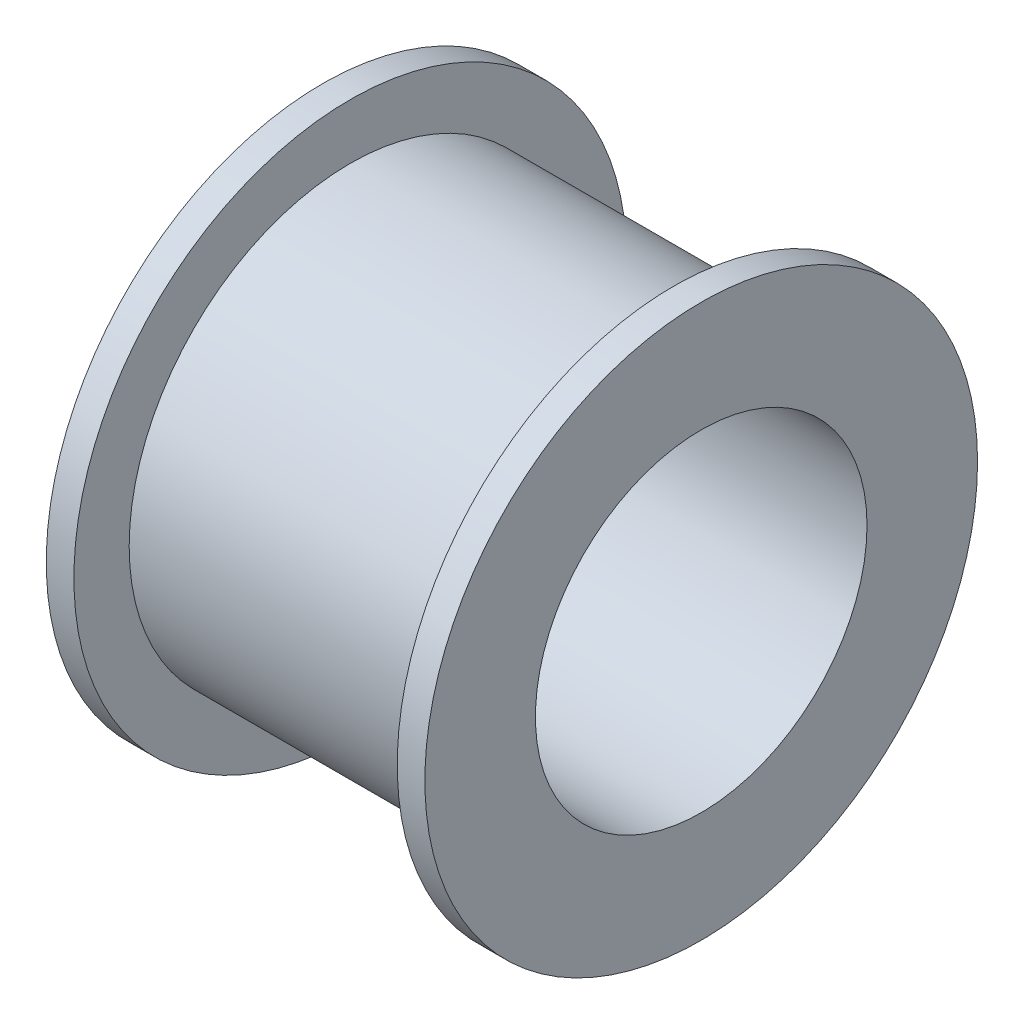
ISO-10303-21;
HEADER;
FILE_DESCRIPTION(('STEP AP214'),'2;1');
FILE_NAME('part.step','',(''),(''),'','','');
FILE_SCHEMA(('AUTOMOTIVE_DESIGN { 1 0 10303 214 1 1 1 1 }'));
ENDSEC;
DATA;
#1=APPLICATION_CONTEXT('core data for automotive mechanical design processes');
#2=APPLICATION_PROTOCOL_DEFINITION('international standard','automotive_design',2000,#1);
#3=PRODUCT_CONTEXT('',#1,'mechanical');
#4=PRODUCT('Part','Part','',(#3));
#5=PRODUCT_RELATED_PRODUCT_CATEGORY('part','',(#4));
#6=PRODUCT_DEFINITION_FORMATION('','',#4);
#7=PRODUCT_DEFINITION_CONTEXT('part definition',#1,'design');
#8=PRODUCT_DEFINITION('design','',#6,#7);
#9=PRODUCT_DEFINITION_SHAPE('','',#8);
#10=(LENGTH_UNIT() NAMED_UNIT(*) SI_UNIT(.MILLI.,.METRE.));
#11=(NAMED_UNIT(*) PLANE_ANGLE_UNIT() SI_UNIT($,.RADIAN.));
#12=(NAMED_UNIT(*) SI_UNIT($,.STERADIAN.) SOLID_ANGLE_UNIT());
#13=UNCERTAINTY_MEASURE_WITH_UNIT(LENGTH_MEASURE(1.E-05),#10,'distance_accuracy_value','');
#14=(GEOMETRIC_REPRESENTATION_CONTEXT(3) GLOBAL_UNCERTAINTY_ASSIGNED_CONTEXT((#13)) GLOBAL_UNIT_ASSIGNED_CONTEXT((#10,
#11,#12)) REPRESENTATION_CONTEXT('',''));
#15=CARTESIAN_POINT('',(0.,0.,0.));
#16=DIRECTION('',(0.,0.,1.));
#17=DIRECTION('',(1.,0.,0.));
#18=AXIS2_PLACEMENT_3D('',#15,#16,#17);
#19=CARTESIAN_POINT('',(71.925,0.,0.));
#20=DIRECTION('',(1.,0.,0.));
#21=DIRECTION('',(0.,0.,-1.));
#22=AXIS2_PLACEMENT_3D('',#19,#20,#21);
#23=CYLINDRICAL_SURFACE('',#22,100.);
#24=CARTESIAN_POINT('',(0.,0.,0.));
#25=DIRECTION('',(1.,0.,0.));
#26=DIRECTION('',(0.,0.,-1.));
#27=AXIS2_PLACEMENT_3D('',#24,#25,#26);
#28=CIRCLE('',#27,100.);
#29=CARTESIAN_POINT('',(0.,0.,-100.));
#30=VERTEX_POINT('',#29);
#31=EDGE_CURVE('E46',#30,#30,#28,.T.);
#32=ORIENTED_EDGE('',*,*,#31,.T.);
#33=EDGE_LOOP('',(#32));
#34=FACE_BOUND('',#33,.T.);
#35=CARTESIAN_POINT('',(9.99999999999999,0.,0.));
#36=DIRECTION('',(1.,0.,0.));
#37=DIRECTION('',(0.,0.,-1.));
#38=AXIS2_PLACEMENT_3D('',#35,#36,#37);
#39=CIRCLE('',#38,100.);
#40=CARTESIAN_POINT('',(9.99999999999999,0.,-100.));
#41=VERTEX_POINT('',#40);
#42=EDGE_CURVE('E10',#41,#41,#39,.T.);
#43=ORIENTED_EDGE('',*,*,#42,.F.);
#44=EDGE_LOOP('',(#43));
#45=FACE_BOUND('',#44,.T.);
#46=ADVANCED_FACE('F32',(#34,#45),#23,.T.);
#47=CARTESIAN_POINT('',(10.,100.,0.));
#48=DIRECTION('',(1.,0.,0.));
#49=DIRECTION('',(0.,0.,-1.));
#50=AXIS2_PLACEMENT_3D('',#47,#48,#49);
#51=PLANE('',#50);
#52=ORIENTED_EDGE('',*,*,#42,.T.);
#53=EDGE_LOOP('',(#52));
#54=FACE_BOUND('',#53,.T.);
#55=CARTESIAN_POINT('',(10.,0.,0.));
#56=DIRECTION('',(1.,0.,0.));
#57=DIRECTION('',(0.,0.,-1.));
#58=AXIS2_PLACEMENT_3D('',#55,#56,#57);
#59=CIRCLE('',#58,80.);
#60=CARTESIAN_POINT('',(10.,0.,-80.));
#61=VERTEX_POINT('',#60);
#62=EDGE_CURVE('E38',#61,#61,#59,.T.);
#63=ORIENTED_EDGE('',*,*,#62,.F.);
#64=EDGE_LOOP('',(#63));
#65=FACE_BOUND('',#64,.T.);
#66=ADVANCED_FACE('F82',(#54,#65),#51,.T.);
#67=CARTESIAN_POINT('',(71.925,0.,0.));
#68=DIRECTION('',(1.,0.,0.));
#69=DIRECTION('',(0.,0.,-1.));
#70=AXIS2_PLACEMENT_3D('',#67,#68,#69);
#71=CYLINDRICAL_SURFACE('',#70,80.);
#72=ORIENTED_EDGE('',*,*,#62,.T.);
#73=EDGE_LOOP('',(#72));
#74=FACE_BOUND('',#73,.T.);
#75=CARTESIAN_POINT('',(127.,0.,0.));
#76=DIRECTION('',(1.,0.,0.));
#77=DIRECTION('',(0.,0.,-1.));
#78=AXIS2_PLACEMENT_3D('',#75,#76,#77);
#79=CIRCLE('',#78,80.);
#80=CARTESIAN_POINT('',(127.,0.,-80.));
#81=VERTEX_POINT('',#80);
#82=EDGE_CURVE('E54',#81,#81,#79,.T.);
#83=ORIENTED_EDGE('',*,*,#82,.F.);
#84=EDGE_LOOP('',(#83));
#85=FACE_BOUND('',#84,.T.);
#86=ADVANCED_FACE('F79',(#74,#85),#71,.T.);
#87=CARTESIAN_POINT('',(71.925,0.,0.));
#88=DIRECTION('',(1.,0.,0.));
#89=DIRECTION('',(0.,0.,-1.));
#90=AXIS2_PLACEMENT_3D('',#87,#88,#89);
#91=CYLINDRICAL_SURFACE('',#90,60.);
#92=CARTESIAN_POINT('',(0.,0.,0.));
#93=DIRECTION('',(1.,0.,0.));
#94=DIRECTION('',(0.,0.,-1.));
#95=AXIS2_PLACEMENT_3D('',#92,#93,#94);
#96=CIRCLE('',#95,60.);
#97=CARTESIAN_POINT('',(0.,0.,-60.));
#98=VERTEX_POINT('',#97);
#99=EDGE_CURVE('E42',#98,#98,#96,.T.);
#100=ORIENTED_EDGE('',*,*,#99,.F.);
#101=EDGE_LOOP('',(#100));
#102=FACE_BOUND('',#101,.T.);
#103=CARTESIAN_POINT('',(137.,0.,0.));
#104=DIRECTION('',(1.,0.,0.));
#105=DIRECTION('',(0.,0.,-1.));
#106=AXIS2_PLACEMENT_3D('',#103,#104,#105);
#107=CIRCLE('',#106,60.);
#108=CARTESIAN_POINT('',(137.,0.,-60.));
#109=VERTEX_POINT('',#108);
#110=EDGE_CURVE('E57',#109,#109,#107,.T.);
#111=ORIENTED_EDGE('',*,*,#110,.T.);
#112=EDGE_LOOP('',(#111));
#113=FACE_BOUND('',#112,.T.);
#114=ADVANCED_FACE('F81',(#102,#113),#91,.F.);
#115=CARTESIAN_POINT('',(0.,100.,0.));
#116=DIRECTION('',(-1.,0.,0.));
#117=DIRECTION('',(0.,0.,1.));
#118=AXIS2_PLACEMENT_3D('',#115,#116,#117);
#119=PLANE('',#118);
#120=ORIENTED_EDGE('',*,*,#99,.T.);
#121=EDGE_LOOP('',(#120));
#122=FACE_BOUND('',#121,.T.);
#123=ORIENTED_EDGE('',*,*,#31,.F.);
#124=EDGE_LOOP('',(#123));
#125=FACE_BOUND('',#124,.T.);
#126=ADVANCED_FACE('F70',(#122,#125),#119,.T.);
#127=CARTESIAN_POINT('',(65.075,0.,0.));
#128=DIRECTION('',(-1.,0.,0.));
#129=DIRECTION('',(0.,0.,-1.));
#130=AXIS2_PLACEMENT_3D('',#127,#128,#129);
#131=CYLINDRICAL_SURFACE('',#130,100.);
#132=CARTESIAN_POINT('',(137.,0.,0.));
#133=DIRECTION('',(1.,0.,0.));
#134=DIRECTION('',(0.,0.,-1.));
#135=AXIS2_PLACEMENT_3D('',#132,#133,#134);
#136=CIRCLE('',#135,100.);
#137=CARTESIAN_POINT('',(137.,0.,-100.));
#138=VERTEX_POINT('',#137);
#139=EDGE_CURVE('E60',#138,#138,#136,.T.);
#140=ORIENTED_EDGE('',*,*,#139,.F.);
#141=EDGE_LOOP('',(#140));
#142=FACE_BOUND('',#141,.T.);
#143=CARTESIAN_POINT('',(127.,0.,0.));
#144=DIRECTION('',(1.,0.,0.));
#145=DIRECTION('',(0.,0.,-1.));
#146=AXIS2_PLACEMENT_3D('',#143,#144,#145);
#147=CIRCLE('',#146,100.);
#148=CARTESIAN_POINT('',(127.,0.,-100.));
#149=VERTEX_POINT('',#148);
#150=EDGE_CURVE('E51',#149,#149,#147,.T.);
#151=ORIENTED_EDGE('',*,*,#150,.T.);
#152=EDGE_LOOP('',(#151));
#153=FACE_BOUND('',#152,.T.);
#154=ADVANCED_FACE('F66',(#142,#153),#131,.T.);
#155=CARTESIAN_POINT('',(127.,100.,0.));
#156=DIRECTION('',(-1.,0.,0.));
#157=DIRECTION('',(0.,0.,-1.));
#158=AXIS2_PLACEMENT_3D('',#155,#156,#157);
#159=PLANE('',#158);
#160=ORIENTED_EDGE('',*,*,#150,.F.);
#161=EDGE_LOOP('',(#160));
#162=FACE_BOUND('',#161,.T.);
#163=ORIENTED_EDGE('',*,*,#82,.T.);
#164=EDGE_LOOP('',(#163));
#165=FACE_BOUND('',#164,.T.);
#166=ADVANCED_FACE('F69',(#162,#165),#159,.T.);
#167=CARTESIAN_POINT('',(137.,100.,0.));
#168=DIRECTION('',(1.,0.,0.));
#169=DIRECTION('',(0.,0.,1.));
#170=AXIS2_PLACEMENT_3D('',#167,#168,#169);
#171=PLANE('',#170);
#172=ORIENTED_EDGE('',*,*,#110,.F.);
#173=EDGE_LOOP('',(#172));
#174=FACE_BOUND('',#173,.T.);
#175=ORIENTED_EDGE('',*,*,#139,.T.);
#176=EDGE_LOOP('',(#175));
#177=FACE_BOUND('',#176,.T.);
#178=ADVANCED_FACE('F64',(#174,#177),#171,.T.);
#179=CLOSED_SHELL('',(#46,#66,#86,#114,#126,#154,#166,#178));
#180=MANIFOLD_SOLID_BREP('B2',#179);
#181=ADVANCED_BREP_SHAPE_REPRESENTATION('',(#18,#180),#14);
#182=SHAPE_DEFINITION_REPRESENTATION(#9,#181);
ENDSEC;
END-ISO-10303-21;
